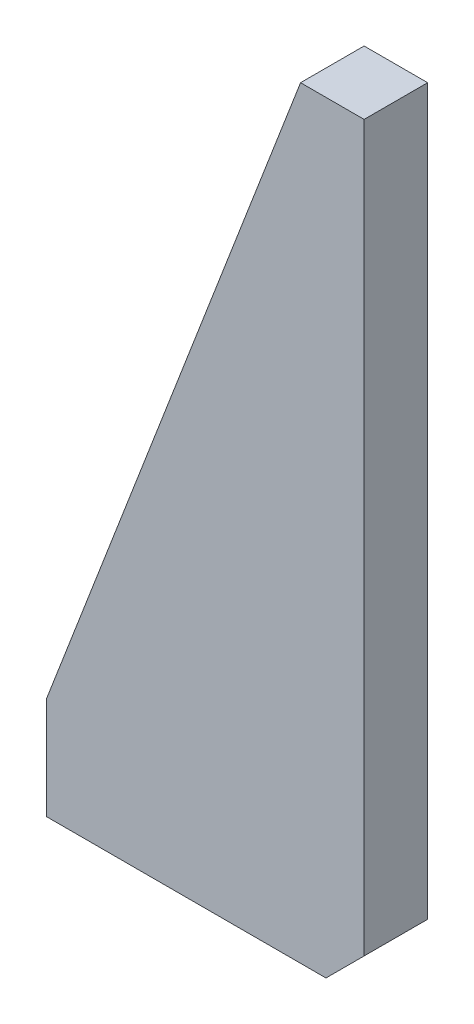
ISO-10303-21;
HEADER;
FILE_DESCRIPTION(('STEP AP214'),'2;1');
FILE_NAME('part.step','',(''),(''),'','','');
FILE_SCHEMA(('AUTOMOTIVE_DESIGN { 1 0 10303 214 1 1 1 1 }'));
ENDSEC;
DATA;
#1=APPLICATION_CONTEXT('core data for automotive mechanical design processes');
#2=APPLICATION_PROTOCOL_DEFINITION('international standard','automotive_design',2000,#1);
#3=PRODUCT_CONTEXT('',#1,'mechanical');
#4=PRODUCT('Part','Part','',(#3));
#5=PRODUCT_RELATED_PRODUCT_CATEGORY('part','',(#4));
#6=PRODUCT_DEFINITION_FORMATION('','',#4);
#7=PRODUCT_DEFINITION_CONTEXT('part definition',#1,'design');
#8=PRODUCT_DEFINITION('design','',#6,#7);
#9=PRODUCT_DEFINITION_SHAPE('','',#8);
#10=(LENGTH_UNIT() NAMED_UNIT(*) SI_UNIT(.MILLI.,.METRE.));
#11=(NAMED_UNIT(*) PLANE_ANGLE_UNIT() SI_UNIT($,.RADIAN.));
#12=(NAMED_UNIT(*) SI_UNIT($,.STERADIAN.) SOLID_ANGLE_UNIT());
#13=UNCERTAINTY_MEASURE_WITH_UNIT(LENGTH_MEASURE(1.E-05),#10,'distance_accuracy_value','');
#14=(GEOMETRIC_REPRESENTATION_CONTEXT(3) GLOBAL_UNCERTAINTY_ASSIGNED_CONTEXT((#13)) GLOBAL_UNIT_ASSIGNED_CONTEXT((#10,
#11,#12)) REPRESENTATION_CONTEXT('',''));
#15=CARTESIAN_POINT('',(0.,0.,0.));
#16=DIRECTION('',(0.,0.,1.));
#17=DIRECTION('',(1.,0.,0.));
#18=AXIS2_PLACEMENT_3D('',#15,#16,#17);
#19=CARTESIAN_POINT('',(0.,0.,12.5));
#20=DIRECTION('',(-1.,0.,0.));
#21=DIRECTION('',(0.,0.,1.));
#22=AXIS2_PLACEMENT_3D('',#19,#20,#21);
#23=PLANE('',#22);
#24=DIRECTION('',(0.,1.,0.));
#25=VECTOR('',#24,1.);
#26=CARTESIAN_POINT('',(0.,0.,12.5));
#27=LINE('',#26,#25);
#28=CARTESIAN_POINT('',(0.,15.,12.5));
#29=VERTEX_POINT('',#28);
#30=CARTESIAN_POINT('',(0.,300.,12.5));
#31=VERTEX_POINT('',#30);
#32=EDGE_CURVE('E90',#29,#31,#27,.T.);
#33=ORIENTED_EDGE('',*,*,#32,.F.);
#34=DIRECTION('',(0.,0.,-1.));
#35=VECTOR('',#34,1.);
#36=CARTESIAN_POINT('',(0.,15.,12.5));
#37=LINE('',#36,#35);
#38=CARTESIAN_POINT('',(0.,15.,-12.5));
#39=VERTEX_POINT('',#38);
#40=EDGE_CURVE('E113',#29,#39,#37,.T.);
#41=ORIENTED_EDGE('',*,*,#40,.T.);
#42=DIRECTION('',(0.,1.,0.));
#43=VECTOR('',#42,1.);
#44=CARTESIAN_POINT('',(0.,0.,-12.5));
#45=LINE('',#44,#43);
#46=CARTESIAN_POINT('',(0.,300.,-12.5));
#47=VERTEX_POINT('',#46);
#48=EDGE_CURVE('E111',#39,#47,#45,.T.);
#49=ORIENTED_EDGE('',*,*,#48,.T.);
#50=DIRECTION('',(0.,0.,-1.));
#51=VECTOR('',#50,1.);
#52=CARTESIAN_POINT('',(0.,300.,12.5));
#53=LINE('',#52,#51);
#54=EDGE_CURVE('E105',#31,#47,#53,.T.);
#55=ORIENTED_EDGE('',*,*,#54,.F.);
#56=EDGE_LOOP('',(#33,#41,#49,#55));
#57=FACE_BOUND('',#56,.T.);
#58=ADVANCED_FACE('F37',(#57),#23,.F.);
#59=CARTESIAN_POINT('',(0.,300.,12.5));
#60=DIRECTION('',(0.,-1.,0.));
#61=DIRECTION('',(0.,0.,-1.));
#62=AXIS2_PLACEMENT_3D('',#59,#60,#61);
#63=PLANE('',#62);
#64=DIRECTION('',(-1.,0.,0.));
#65=VECTOR('',#64,1.);
#66=CARTESIAN_POINT('',(0.,300.,-12.5));
#67=LINE('',#66,#65);
#68=CARTESIAN_POINT('',(-24.9999999999999,300.,-12.5));
#69=VERTEX_POINT('',#68);
#70=EDGE_CURVE('E131',#47,#69,#67,.T.);
#71=ORIENTED_EDGE('',*,*,#70,.T.);
#72=DIRECTION('',(0.,0.,-1.));
#73=VECTOR('',#72,1.);
#74=CARTESIAN_POINT('',(-24.9999999999999,300.,12.5));
#75=LINE('',#74,#73);
#76=CARTESIAN_POINT('',(-24.9999999999999,300.,12.5));
#77=VERTEX_POINT('',#76);
#78=EDGE_CURVE('E107',#77,#69,#75,.T.);
#79=ORIENTED_EDGE('',*,*,#78,.F.);
#80=DIRECTION('',(-1.,0.,0.));
#81=VECTOR('',#80,1.);
#82=CARTESIAN_POINT('',(0.,300.,12.5));
#83=LINE('',#82,#81);
#84=EDGE_CURVE('E93',#31,#77,#83,.T.);
#85=ORIENTED_EDGE('',*,*,#84,.F.);
#86=ORIENTED_EDGE('',*,*,#54,.T.);
#87=EDGE_LOOP('',(#71,#79,#85,#86));
#88=FACE_BOUND('',#87,.T.);
#89=ADVANCED_FACE('F104',(#88),#63,.F.);
#90=CARTESIAN_POINT('',(-24.9999999999999,300.,12.5));
#91=DIRECTION('',(0.933345606203059,-0.358979079308869,0.));
#92=DIRECTION('',(0.358979079308869,0.93334560620306,0.));
#93=AXIS2_PLACEMENT_3D('',#90,#91,#92);
#94=PLANE('',#93);
#95=DIRECTION('',(-0.358979079308869,-0.933345606203059,0.));
#96=VECTOR('',#95,1.);
#97=CARTESIAN_POINT('',(-24.9999999999999,300.,-12.5));
#98=LINE('',#97,#96);
#99=CARTESIAN_POINT('',(-125.,40.,-12.5));
#100=VERTEX_POINT('',#99);
#101=EDGE_CURVE('E129',#69,#100,#98,.T.);
#102=ORIENTED_EDGE('',*,*,#101,.T.);
#103=DIRECTION('',(0.,0.,-1.));
#104=VECTOR('',#103,1.);
#105=CARTESIAN_POINT('',(-125.,40.,12.5));
#106=LINE('',#105,#104);
#107=CARTESIAN_POINT('',(-125.,40.,12.5));
#108=VERTEX_POINT('',#107);
#109=EDGE_CURVE('E116',#108,#100,#106,.T.);
#110=ORIENTED_EDGE('',*,*,#109,.F.);
#111=DIRECTION('',(-0.358979079308869,-0.933345606203059,0.));
#112=VECTOR('',#111,1.);
#113=CARTESIAN_POINT('',(-24.9999999999999,300.,12.5));
#114=LINE('',#113,#112);
#115=EDGE_CURVE('E109',#77,#108,#114,.T.);
#116=ORIENTED_EDGE('',*,*,#115,.F.);
#117=ORIENTED_EDGE('',*,*,#78,.T.);
#118=EDGE_LOOP('',(#102,#110,#116,#117));
#119=FACE_BOUND('',#118,.T.);
#120=ADVANCED_FACE('F141',(#119),#94,.F.);
#121=CARTESIAN_POINT('',(-125.,40.,12.5));
#122=DIRECTION('',(1.,0.,0.));
#123=DIRECTION('',(0.,0.,-1.));
#124=AXIS2_PLACEMENT_3D('',#121,#122,#123);
#125=PLANE('',#124);
#126=DIRECTION('',(0.,-1.,0.));
#127=VECTOR('',#126,1.);
#128=CARTESIAN_POINT('',(-125.,40.,-12.5));
#129=LINE('',#128,#127);
#130=CARTESIAN_POINT('',(-125.,0.,-12.5));
#131=VERTEX_POINT('',#130);
#132=EDGE_CURVE('E127',#100,#131,#129,.T.);
#133=ORIENTED_EDGE('',*,*,#132,.T.);
#134=DIRECTION('',(0.,0.,-1.));
#135=VECTOR('',#134,1.);
#136=CARTESIAN_POINT('',(-125.,0.,12.5));
#137=LINE('',#136,#135);
#138=CARTESIAN_POINT('',(-125.,0.,12.5));
#139=VERTEX_POINT('',#138);
#140=EDGE_CURVE('E122',#139,#131,#137,.T.);
#141=ORIENTED_EDGE('',*,*,#140,.F.);
#142=DIRECTION('',(0.,-1.,0.));
#143=VECTOR('',#142,1.);
#144=CARTESIAN_POINT('',(-125.,40.,12.5));
#145=LINE('',#144,#143);
#146=EDGE_CURVE('E135',#108,#139,#145,.T.);
#147=ORIENTED_EDGE('',*,*,#146,.F.);
#148=ORIENTED_EDGE('',*,*,#109,.T.);
#149=EDGE_LOOP('',(#133,#141,#147,#148));
#150=FACE_BOUND('',#149,.T.);
#151=ADVANCED_FACE('F145',(#150),#125,.F.);
#152=CARTESIAN_POINT('',(-125.,0.,12.5));
#153=DIRECTION('',(0.,1.,0.));
#154=DIRECTION('',(0.,0.,1.));
#155=AXIS2_PLACEMENT_3D('',#152,#153,#154);
#156=PLANE('',#155);
#157=DIRECTION('',(1.,0.,0.));
#158=VECTOR('',#157,1.);
#159=CARTESIAN_POINT('',(-125.,0.,-12.5));
#160=LINE('',#159,#158);
#161=CARTESIAN_POINT('',(-15.0000000000001,0.,-12.5));
#162=VERTEX_POINT('',#161);
#163=EDGE_CURVE('E100',#131,#162,#160,.T.);
#164=ORIENTED_EDGE('',*,*,#163,.T.);
#165=DIRECTION('',(0.,0.,1.));
#166=VECTOR('',#165,1.);
#167=CARTESIAN_POINT('',(-15.0000000000001,0.,12.5));
#168=LINE('',#167,#166);
#169=CARTESIAN_POINT('',(-15.0000000000001,0.,12.5));
#170=VERTEX_POINT('',#169);
#171=EDGE_CURVE('E46',#162,#170,#168,.T.);
#172=ORIENTED_EDGE('',*,*,#171,.T.);
#173=DIRECTION('',(1.,0.,0.));
#174=VECTOR('',#173,1.);
#175=CARTESIAN_POINT('',(-125.,0.,12.5));
#176=LINE('',#175,#174);
#177=EDGE_CURVE('E125',#139,#170,#176,.T.);
#178=ORIENTED_EDGE('',*,*,#177,.F.);
#179=ORIENTED_EDGE('',*,*,#140,.T.);
#180=EDGE_LOOP('',(#164,#172,#178,#179));
#181=FACE_BOUND('',#180,.T.);
#182=ADVANCED_FACE('F146',(#181),#156,.F.);
#183=CARTESIAN_POINT('',(0.,0.,12.5));
#184=DIRECTION('',(0.,0.,1.));
#185=DIRECTION('',(1.,0.,0.));
#186=AXIS2_PLACEMENT_3D('',#183,#184,#185);
#187=PLANE('',#186);
#188=ORIENTED_EDGE('',*,*,#177,.T.);
#189=DIRECTION('',(-0.70710678118655,-0.707106781186546,0.));
#190=VECTOR('',#189,1.);
#191=CARTESIAN_POINT('',(-7.49999999999999,7.50000000000004,12.5));
#192=LINE('',#191,#190);
#193=EDGE_CURVE('E11',#170,#29,#192,.F.);
#194=ORIENTED_EDGE('',*,*,#193,.T.);
#195=ORIENTED_EDGE('',*,*,#32,.T.);
#196=ORIENTED_EDGE('',*,*,#84,.T.);
#197=ORIENTED_EDGE('',*,*,#115,.T.);
#198=ORIENTED_EDGE('',*,*,#146,.T.);
#199=EDGE_LOOP('',(#188,#194,#195,#196,#197,#198));
#200=FACE_BOUND('',#199,.T.);
#201=ADVANCED_FACE('F92',(#200),#187,.T.);
#202=CARTESIAN_POINT('',(0.,0.,-12.5));
#203=DIRECTION('',(0.,0.,1.));
#204=DIRECTION('',(1.,0.,0.));
#205=AXIS2_PLACEMENT_3D('',#202,#203,#204);
#206=PLANE('',#205);
#207=ORIENTED_EDGE('',*,*,#48,.F.);
#208=DIRECTION('',(0.70710678118655,0.707106781186546,0.));
#209=VECTOR('',#208,1.);
#210=CARTESIAN_POINT('',(0.,15.,-12.5));
#211=LINE('',#210,#209);
#212=EDGE_CURVE('E60',#39,#162,#211,.F.);
#213=ORIENTED_EDGE('',*,*,#212,.T.);
#214=ORIENTED_EDGE('',*,*,#163,.F.);
#215=ORIENTED_EDGE('',*,*,#132,.F.);
#216=ORIENTED_EDGE('',*,*,#101,.F.);
#217=ORIENTED_EDGE('',*,*,#70,.F.);
#218=EDGE_LOOP('',(#207,#213,#214,#215,#216,#217));
#219=FACE_BOUND('',#218,.T.);
#220=ADVANCED_FACE('F148',(#219),#206,.F.);
#221=CARTESIAN_POINT('',(0.,15.,12.5));
#222=DIRECTION('',(-0.707106781186545,0.707106781186549,0.));
#223=DIRECTION('',(0.,0.,-1.));
#224=AXIS2_PLACEMENT_3D('',#221,#222,#223);
#225=PLANE('',#224);
#226=ORIENTED_EDGE('',*,*,#193,.F.);
#227=ORIENTED_EDGE('',*,*,#171,.F.);
#228=ORIENTED_EDGE('',*,*,#212,.F.);
#229=ORIENTED_EDGE('',*,*,#40,.F.);
#230=EDGE_LOOP('',(#226,#227,#228,#229));
#231=FACE_BOUND('',#230,.T.);
#232=ADVANCED_FACE('F40',(#231),#225,.F.);
#233=CLOSED_SHELL('',(#58,#89,#120,#151,#182,#201,#220,#232));
#234=MANIFOLD_SOLID_BREP('B2',#233);
#235=ADVANCED_BREP_SHAPE_REPRESENTATION('',(#18,#234),#14);
#236=SHAPE_DEFINITION_REPRESENTATION(#9,#235);
ENDSEC;
END-ISO-10303-21;
